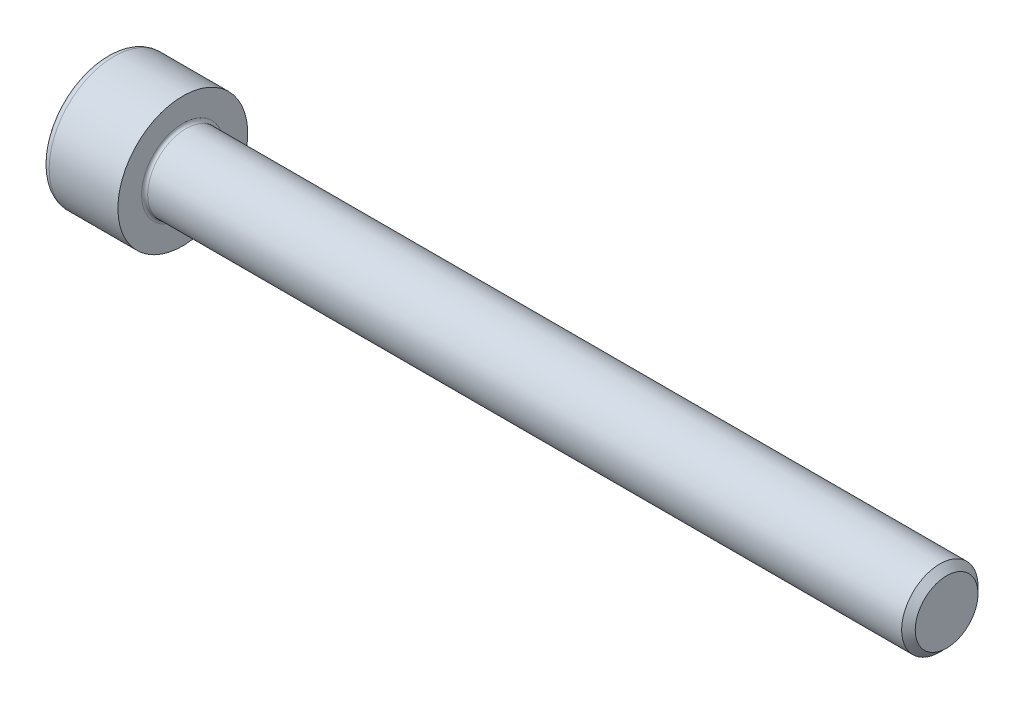
ISO-10303-21;
HEADER;
FILE_DESCRIPTION(('STEP AP214'),'2;1');
FILE_NAME('part.step','',(''),(''),'','','');
FILE_SCHEMA(('AUTOMOTIVE_DESIGN { 1 0 10303 214 1 1 1 1 }'));
ENDSEC;
DATA;
#1=APPLICATION_CONTEXT('core data for automotive mechanical design processes');
#2=APPLICATION_PROTOCOL_DEFINITION('international standard','automotive_design',2000,#1);
#3=PRODUCT_CONTEXT('',#1,'mechanical');
#4=PRODUCT('Part','Part','',(#3));
#5=PRODUCT_RELATED_PRODUCT_CATEGORY('part','',(#4));
#6=PRODUCT_DEFINITION_FORMATION('','',#4);
#7=PRODUCT_DEFINITION_CONTEXT('part definition',#1,'design');
#8=PRODUCT_DEFINITION('design','',#6,#7);
#9=PRODUCT_DEFINITION_SHAPE('','',#8);
#10=(LENGTH_UNIT() NAMED_UNIT(*) SI_UNIT(.MILLI.,.METRE.));
#11=(NAMED_UNIT(*) PLANE_ANGLE_UNIT() SI_UNIT($,.RADIAN.));
#12=(NAMED_UNIT(*) SI_UNIT($,.STERADIAN.) SOLID_ANGLE_UNIT());
#13=UNCERTAINTY_MEASURE_WITH_UNIT(LENGTH_MEASURE(1.E-05),#10,'distance_accuracy_value','');
#14=(GEOMETRIC_REPRESENTATION_CONTEXT(3) GLOBAL_UNCERTAINTY_ASSIGNED_CONTEXT((#13)) GLOBAL_UNIT_ASSIGNED_CONTEXT((#10,
#11,#12)) REPRESENTATION_CONTEXT('',''));
#15=CARTESIAN_POINT('',(0.,0.,0.));
#16=DIRECTION('',(0.,0.,1.));
#17=DIRECTION('',(1.,0.,0.));
#18=AXIS2_PLACEMENT_3D('',#15,#16,#17);
#19=CARTESIAN_POINT('',(0.,0.,0.));
#20=DIRECTION('',(-1.,0.,0.));
#21=DIRECTION('',(0.,0.,1.));
#22=AXIS2_PLACEMENT_3D('',#19,#20,#21);
#23=PLANE('',#22);
#24=DIRECTION('',(0.,-0.499999999999999,0.866025403784439));
#25=VECTOR('',#24,1.);
#26=CARTESIAN_POINT('',(0.,2.32094808214229,0.));
#27=LINE('',#26,#25);
#28=CARTESIAN_POINT('',(0.,2.32094808214229,0.));
#29=VERTEX_POINT('',#28);
#30=CARTESIAN_POINT('',(0.,1.16047404107115,2.01));
#31=VERTEX_POINT('',#30);
#32=EDGE_CURVE('E373',#29,#31,#27,.T.);
#33=ORIENTED_EDGE('',*,*,#32,.T.);
#34=DIRECTION('',(0.,1.,0.));
#35=VECTOR('',#34,1.);
#36=CARTESIAN_POINT('',(0.,-1.16047404107115,2.01));
#37=LINE('',#36,#35);
#38=CARTESIAN_POINT('',(0.,-1.16047404107115,2.01));
#39=VERTEX_POINT('',#38);
#40=EDGE_CURVE('E130',#39,#31,#37,.T.);
#41=ORIENTED_EDGE('',*,*,#40,.F.);
#42=DIRECTION('',(0.,-0.500000000000001,-0.866025403784438));
#43=VECTOR('',#42,1.);
#44=CARTESIAN_POINT('',(0.,-1.16047404107115,2.01));
#45=LINE('',#44,#43);
#46=CARTESIAN_POINT('',(0.,-2.3209480821423,0.));
#47=VERTEX_POINT('',#46);
#48=EDGE_CURVE('E376',#39,#47,#45,.T.);
#49=ORIENTED_EDGE('',*,*,#48,.T.);
#50=DIRECTION('',(0.,0.499999999999999,-0.866025403784439));
#51=VECTOR('',#50,1.);
#52=CARTESIAN_POINT('',(0.,-2.3209480821423,0.));
#53=LINE('',#52,#51);
#54=CARTESIAN_POINT('',(0.,-1.16047404107116,-2.01));
#55=VERTEX_POINT('',#54);
#56=EDGE_CURVE('E379',#47,#55,#53,.T.);
#57=ORIENTED_EDGE('',*,*,#56,.T.);
#58=DIRECTION('',(0.,-1.,0.));
#59=VECTOR('',#58,1.);
#60=CARTESIAN_POINT('',(0.,1.16047404107114,-2.01));
#61=LINE('',#60,#59);
#62=CARTESIAN_POINT('',(0.,1.16047404107114,-2.01));
#63=VERTEX_POINT('',#62);
#64=EDGE_CURVE('E382',#63,#55,#61,.T.);
#65=ORIENTED_EDGE('',*,*,#64,.F.);
#66=DIRECTION('',(0.,-0.500000000000001,-0.866025403784438));
#67=VECTOR('',#66,1.);
#68=CARTESIAN_POINT('',(0.,2.32094808214229,0.));
#69=LINE('',#68,#67);
#70=EDGE_CURVE('E125',#29,#63,#69,.T.);
#71=ORIENTED_EDGE('',*,*,#70,.F.);
#72=EDGE_LOOP('',(#33,#41,#49,#57,#65,#71));
#73=FACE_BOUND('',#72,.T.);
#74=CARTESIAN_POINT('',(0.,0.,0.));
#75=DIRECTION('',(-1.,0.,0.));
#76=DIRECTION('',(0.,0.,1.));
#77=AXIS2_PLACEMENT_3D('',#74,#75,#76);
#78=CIRCLE('',#77,3.75);
#79=CARTESIAN_POINT('',(0.,0.,3.75));
#80=VERTEX_POINT('',#79);
#81=EDGE_CURVE('E42',#80,#80,#78,.T.);
#82=ORIENTED_EDGE('',*,*,#81,.T.);
#83=EDGE_LOOP('',(#82));
#84=FACE_BOUND('',#83,.T.);
#85=ADVANCED_FACE('F34',(#73,#84),#23,.T.);
#86=CARTESIAN_POINT('',(55.,2.055,0.));
#87=DIRECTION('',(1.,0.,0.));
#88=DIRECTION('',(0.,0.,-1.));
#89=AXIS2_PLACEMENT_3D('',#86,#87,#88);
#90=PLANE('',#89);
#91=CARTESIAN_POINT('',(55.,0.,0.));
#92=DIRECTION('',(-1.,0.,0.));
#93=DIRECTION('',(0.,0.,1.));
#94=AXIS2_PLACEMENT_3D('',#91,#92,#93);
#95=CIRCLE('',#94,2.055);
#96=CARTESIAN_POINT('',(55.,0.,2.055));
#97=VERTEX_POINT('',#96);
#98=EDGE_CURVE('E148',#97,#97,#95,.T.);
#99=ORIENTED_EDGE('',*,*,#98,.F.);
#100=EDGE_LOOP('',(#99));
#101=FACE_BOUND('',#100,.T.);
#102=ADVANCED_FACE('F172',(#101),#90,.T.);
#103=CARTESIAN_POINT('',(55.,0.,0.));
#104=DIRECTION('',(-1.,0.,0.));
#105=DIRECTION('',(0.,0.,1.));
#106=AXIS2_PLACEMENT_3D('',#103,#104,#105);
#107=CONICAL_SURFACE('',#106,2.055,0.785398163397316);
#108=CARTESIAN_POINT('',(54.5549999999999,0.,0.));
#109=DIRECTION('',(-1.,0.,0.));
#110=DIRECTION('',(0.,0.,1.));
#111=AXIS2_PLACEMENT_3D('',#108,#109,#110);
#112=CIRCLE('',#111,2.49999999999994);
#113=CARTESIAN_POINT('',(54.5549999999999,0.,2.49999999999994));
#114=VERTEX_POINT('',#113);
#115=EDGE_CURVE('E145',#114,#114,#112,.T.);
#116=ORIENTED_EDGE('',*,*,#115,.F.);
#117=EDGE_LOOP('',(#116));
#118=FACE_BOUND('',#117,.T.);
#119=ORIENTED_EDGE('',*,*,#98,.T.);
#120=EDGE_LOOP('',(#119));
#121=FACE_BOUND('',#120,.T.);
#122=ADVANCED_FACE('F178',(#118,#121),#107,.T.);
#123=CARTESIAN_POINT('',(-31.75,0.,0.));
#124=DIRECTION('',(-1.,0.,0.));
#125=DIRECTION('',(0.,0.,1.));
#126=AXIS2_PLACEMENT_3D('',#123,#124,#125);
#127=CYLINDRICAL_SURFACE('',#126,2.49999999999997);
#128=CARTESIAN_POINT('',(5.2,0.,0.));
#129=DIRECTION('',(1.,0.,0.));
#130=DIRECTION('',(0.,0.,-1.));
#131=AXIS2_PLACEMENT_3D('',#128,#129,#130);
#132=CIRCLE('',#131,2.49999999999997);
#133=CARTESIAN_POINT('',(5.2,0.,-2.49999999999997));
#134=VERTEX_POINT('',#133);
#135=EDGE_CURVE('E154',#134,#134,#132,.T.);
#136=ORIENTED_EDGE('',*,*,#135,.T.);
#137=EDGE_LOOP('',(#136));
#138=FACE_BOUND('',#137,.T.);
#139=ORIENTED_EDGE('',*,*,#115,.T.);
#140=EDGE_LOOP('',(#139));
#141=FACE_BOUND('',#140,.T.);
#142=ADVANCED_FACE('F190',(#138,#141),#127,.T.);
#143=CARTESIAN_POINT('',(5.,4.25,0.));
#144=DIRECTION('',(1.,0.,0.));
#145=DIRECTION('',(0.,0.,-1.));
#146=AXIS2_PLACEMENT_3D('',#143,#144,#145);
#147=PLANE('',#146);
#148=CARTESIAN_POINT('',(5.,0.,0.));
#149=DIRECTION('',(1.,0.,0.));
#150=DIRECTION('',(0.,0.,-1.));
#151=AXIS2_PLACEMENT_3D('',#148,#149,#150);
#152=CIRCLE('',#151,2.69999999999997);
#153=CARTESIAN_POINT('',(5.,0.,-2.69999999999997));
#154=VERTEX_POINT('',#153);
#155=EDGE_CURVE('E151',#154,#154,#152,.F.);
#156=ORIENTED_EDGE('',*,*,#155,.T.);
#157=EDGE_LOOP('',(#156));
#158=FACE_BOUND('',#157,.T.);
#159=CARTESIAN_POINT('',(5.,0.,0.));
#160=DIRECTION('',(-1.,0.,0.));
#161=DIRECTION('',(0.,0.,1.));
#162=AXIS2_PLACEMENT_3D('',#159,#160,#161);
#163=CIRCLE('',#162,4.25);
#164=CARTESIAN_POINT('',(5.,0.,4.25));
#165=VERTEX_POINT('',#164);
#166=EDGE_CURVE('E141',#165,#165,#163,.T.);
#167=ORIENTED_EDGE('',*,*,#166,.F.);
#168=EDGE_LOOP('',(#167));
#169=FACE_BOUND('',#168,.T.);
#170=ADVANCED_FACE('F186',(#158,#169),#147,.T.);
#171=CARTESIAN_POINT('',(-31.75,0.,0.));
#172=DIRECTION('',(-1.,0.,0.));
#173=DIRECTION('',(0.,0.,1.));
#174=AXIS2_PLACEMENT_3D('',#171,#172,#173);
#175=CYLINDRICAL_SURFACE('',#174,4.25);
#176=CARTESIAN_POINT('',(0.5,0.,0.));
#177=DIRECTION('',(-1.,0.,0.));
#178=DIRECTION('',(0.,0.,1.));
#179=AXIS2_PLACEMENT_3D('',#176,#177,#178);
#180=CIRCLE('',#179,4.25);
#181=CARTESIAN_POINT('',(0.5,0.,4.25));
#182=VERTEX_POINT('',#181);
#183=EDGE_CURVE('E11',#182,#182,#180,.F.);
#184=ORIENTED_EDGE('',*,*,#183,.T.);
#185=EDGE_LOOP('',(#184));
#186=FACE_BOUND('',#185,.T.);
#187=ORIENTED_EDGE('',*,*,#166,.T.);
#188=EDGE_LOOP('',(#187));
#189=FACE_BOUND('',#188,.T.);
#190=ADVANCED_FACE('F168',(#186,#189),#175,.T.);
#191=CARTESIAN_POINT('',(5.2,0.,0.));
#192=DIRECTION('',(1.,0.,0.));
#193=DIRECTION('',(0.,0.,-1.));
#194=AXIS2_PLACEMENT_3D('',#191,#192,#193);
#195=TOROIDAL_SURFACE('',#194,2.69999999999997,0.2);
#196=ORIENTED_EDGE('',*,*,#135,.F.);
#197=EDGE_LOOP('',(#196));
#198=FACE_BOUND('',#197,.T.);
#199=ORIENTED_EDGE('',*,*,#155,.F.);
#200=EDGE_LOOP('',(#199));
#201=FACE_BOUND('',#200,.T.);
#202=ADVANCED_FACE('F161',(#198,#201),#195,.F.);
#203=CARTESIAN_POINT('',(0.5,0.,0.));
#204=DIRECTION('',(-1.,0.,0.));
#205=DIRECTION('',(0.,0.,1.));
#206=AXIS2_PLACEMENT_3D('',#203,#204,#205);
#207=TOROIDAL_SURFACE('',#206,3.75,0.5);
#208=ORIENTED_EDGE('',*,*,#183,.F.);
#209=EDGE_LOOP('',(#208));
#210=FACE_BOUND('',#209,.T.);
#211=ORIENTED_EDGE('',*,*,#81,.F.);
#212=EDGE_LOOP('',(#211));
#213=FACE_BOUND('',#212,.T.);
#214=ADVANCED_FACE('F36',(#210,#213),#207,.T.);
#215=CARTESIAN_POINT('',(2.5,2.32094808214229,0.));
#216=DIRECTION('',(0.,-0.866025403784439,-0.499999999999999));
#217=DIRECTION('',(0.,0.499999999999999,-0.866025403784439));
#218=AXIS2_PLACEMENT_3D('',#215,#216,#217);
#219=PLANE('',#218);
#220=ORIENTED_EDGE('',*,*,#32,.F.);
#221=DIRECTION('',(-1.,0.,0.));
#222=VECTOR('',#221,1.);
#223=CARTESIAN_POINT('',(2.5,2.32094808214229,0.));
#224=LINE('',#223,#222);
#225=CARTESIAN_POINT('',(2.5,2.32094808214229,0.));
#226=VERTEX_POINT('',#225);
#227=EDGE_CURVE('E363',#226,#29,#224,.T.);
#228=ORIENTED_EDGE('',*,*,#227,.F.);
#229=DIRECTION('',(0.,-0.499999999999999,0.866025403784439));
#230=VECTOR('',#229,1.);
#231=CARTESIAN_POINT('',(2.5,2.32094808214229,0.));
#232=LINE('',#231,#230);
#233=CARTESIAN_POINT('',(2.5,1.74071106160672,1.00499999999999));
#234=VERTEX_POINT('',#233);
#235=EDGE_CURVE('E117',#226,#234,#232,.T.);
#236=ORIENTED_EDGE('',*,*,#235,.T.);
#237=CARTESIAN_POINT('',(2.5,1.16047404107115,2.01));
#238=VERTEX_POINT('',#237);
#239=EDGE_CURVE('E108',#234,#238,#232,.T.);
#240=ORIENTED_EDGE('',*,*,#239,.T.);
#241=DIRECTION('',(-1.,0.,0.));
#242=VECTOR('',#241,1.);
#243=CARTESIAN_POINT('',(2.5,1.16047404107115,2.01));
#244=LINE('',#243,#242);
#245=EDGE_CURVE('E122',#238,#31,#244,.T.);
#246=ORIENTED_EDGE('',*,*,#245,.T.);
#247=EDGE_LOOP('',(#220,#228,#236,#240,#246));
#248=FACE_BOUND('',#247,.T.);
#249=ADVANCED_FACE('F121',(#248),#219,.T.);
#250=CARTESIAN_POINT('',(2.5,-1.16047404107115,2.01));
#251=DIRECTION('',(0.,0.,1.));
#252=DIRECTION('',(0.,-1.,0.));
#253=AXIS2_PLACEMENT_3D('',#250,#251,#252);
#254=PLANE('',#253);
#255=ORIENTED_EDGE('',*,*,#40,.T.);
#256=ORIENTED_EDGE('',*,*,#245,.F.);
#257=DIRECTION('',(0.,1.,0.));
#258=VECTOR('',#257,1.);
#259=CARTESIAN_POINT('',(2.5,-1.16047404107115,2.01));
#260=LINE('',#259,#258);
#261=CARTESIAN_POINT('',(2.5,0.,2.01));
#262=VERTEX_POINT('',#261);
#263=EDGE_CURVE('E105',#262,#238,#260,.T.);
#264=ORIENTED_EDGE('',*,*,#263,.F.);
#265=CARTESIAN_POINT('',(2.5,-1.16047404107115,2.01));
#266=VERTEX_POINT('',#265);
#267=EDGE_CURVE('E116',#266,#262,#260,.T.);
#268=ORIENTED_EDGE('',*,*,#267,.F.);
#269=DIRECTION('',(-1.,0.,0.));
#270=VECTOR('',#269,1.);
#271=CARTESIAN_POINT('',(2.5,-1.16047404107115,2.01));
#272=LINE('',#271,#270);
#273=EDGE_CURVE('E132',#266,#39,#272,.T.);
#274=ORIENTED_EDGE('',*,*,#273,.T.);
#275=EDGE_LOOP('',(#255,#256,#264,#268,#274));
#276=FACE_BOUND('',#275,.T.);
#277=ADVANCED_FACE('F127',(#276),#254,.F.);
#278=CARTESIAN_POINT('',(2.5,-1.16047404107115,2.01));
#279=DIRECTION('',(0.,0.866025403784438,-0.500000000000001));
#280=DIRECTION('',(0.,0.500000000000001,0.866025403784438));
#281=AXIS2_PLACEMENT_3D('',#278,#279,#280);
#282=PLANE('',#281);
#283=ORIENTED_EDGE('',*,*,#48,.F.);
#284=ORIENTED_EDGE('',*,*,#273,.F.);
#285=DIRECTION('',(0.,-0.500000000000001,-0.866025403784438));
#286=VECTOR('',#285,1.);
#287=CARTESIAN_POINT('',(2.5,-1.16047404107115,2.01));
#288=LINE('',#287,#286);
#289=CARTESIAN_POINT('',(2.5,-1.74071106160672,1.005));
#290=VERTEX_POINT('',#289);
#291=EDGE_CURVE('E402',#266,#290,#288,.T.);
#292=ORIENTED_EDGE('',*,*,#291,.T.);
#293=CARTESIAN_POINT('',(2.5,-2.3209480821423,0.));
#294=VERTEX_POINT('',#293);
#295=EDGE_CURVE('E391',#290,#294,#288,.T.);
#296=ORIENTED_EDGE('',*,*,#295,.T.);
#297=DIRECTION('',(-1.,0.,0.));
#298=VECTOR('',#297,1.);
#299=CARTESIAN_POINT('',(2.5,-2.3209480821423,0.));
#300=LINE('',#299,#298);
#301=EDGE_CURVE('E137',#294,#47,#300,.T.);
#302=ORIENTED_EDGE('',*,*,#301,.T.);
#303=EDGE_LOOP('',(#283,#284,#292,#296,#302));
#304=FACE_BOUND('',#303,.T.);
#305=ADVANCED_FACE('F254',(#304),#282,.T.);
#306=CARTESIAN_POINT('',(2.5,-2.3209480821423,0.));
#307=DIRECTION('',(0.,0.866025403784439,0.499999999999999));
#308=DIRECTION('',(0.,-0.499999999999999,0.86602540378444));
#309=AXIS2_PLACEMENT_3D('',#306,#307,#308);
#310=PLANE('',#309);
#311=ORIENTED_EDGE('',*,*,#56,.F.);
#312=ORIENTED_EDGE('',*,*,#301,.F.);
#313=DIRECTION('',(0.,0.499999999999999,-0.866025403784439));
#314=VECTOR('',#313,1.);
#315=CARTESIAN_POINT('',(2.5,-2.3209480821423,0.));
#316=LINE('',#315,#314);
#317=CARTESIAN_POINT('',(2.5,-1.74071106160673,-1.005));
#318=VERTEX_POINT('',#317);
#319=EDGE_CURVE('E369',#294,#318,#316,.T.);
#320=ORIENTED_EDGE('',*,*,#319,.T.);
#321=CARTESIAN_POINT('',(2.5,-1.16047404107116,-2.01));
#322=VERTEX_POINT('',#321);
#323=EDGE_CURVE('E401',#318,#322,#316,.T.);
#324=ORIENTED_EDGE('',*,*,#323,.T.);
#325=DIRECTION('',(-1.,0.,0.));
#326=VECTOR('',#325,1.);
#327=CARTESIAN_POINT('',(2.5,-1.16047404107116,-2.01));
#328=LINE('',#327,#326);
#329=EDGE_CURVE('E362',#322,#55,#328,.T.);
#330=ORIENTED_EDGE('',*,*,#329,.T.);
#331=EDGE_LOOP('',(#311,#312,#320,#324,#330));
#332=FACE_BOUND('',#331,.T.);
#333=ADVANCED_FACE('F262',(#332),#310,.T.);
#334=CARTESIAN_POINT('',(2.5,1.16047404107114,-2.01));
#335=DIRECTION('',(0.,0.,-1.));
#336=DIRECTION('',(0.,1.,0.));
#337=AXIS2_PLACEMENT_3D('',#334,#335,#336);
#338=PLANE('',#337);
#339=ORIENTED_EDGE('',*,*,#64,.T.);
#340=ORIENTED_EDGE('',*,*,#329,.F.);
#341=DIRECTION('',(0.,-1.,0.));
#342=VECTOR('',#341,1.);
#343=CARTESIAN_POINT('',(2.5,1.16047404107114,-2.01));
#344=LINE('',#343,#342);
#345=CARTESIAN_POINT('',(2.5,0.,-2.01));
#346=VERTEX_POINT('',#345);
#347=EDGE_CURVE('E366',#346,#322,#344,.T.);
#348=ORIENTED_EDGE('',*,*,#347,.F.);
#349=CARTESIAN_POINT('',(2.5,1.16047404107114,-2.01));
#350=VERTEX_POINT('',#349);
#351=EDGE_CURVE('E49',#350,#346,#344,.T.);
#352=ORIENTED_EDGE('',*,*,#351,.F.);
#353=DIRECTION('',(-1.,0.,0.));
#354=VECTOR('',#353,1.);
#355=CARTESIAN_POINT('',(2.5,1.16047404107114,-2.01));
#356=LINE('',#355,#354);
#357=EDGE_CURVE('E359',#350,#63,#356,.T.);
#358=ORIENTED_EDGE('',*,*,#357,.T.);
#359=EDGE_LOOP('',(#339,#340,#348,#352,#358));
#360=FACE_BOUND('',#359,.T.);
#361=ADVANCED_FACE('F271',(#360),#338,.F.);
#362=CARTESIAN_POINT('',(2.5,2.32094808214229,0.));
#363=DIRECTION('',(0.,0.866025403784438,-0.500000000000001));
#364=DIRECTION('',(0.,0.500000000000001,0.866025403784438));
#365=AXIS2_PLACEMENT_3D('',#362,#363,#364);
#366=PLANE('',#365);
#367=ORIENTED_EDGE('',*,*,#70,.T.);
#368=ORIENTED_EDGE('',*,*,#357,.F.);
#369=DIRECTION('',(0.,-0.500000000000001,-0.866025403784438));
#370=VECTOR('',#369,1.);
#371=CARTESIAN_POINT('',(2.5,2.32094808214229,0.));
#372=LINE('',#371,#370);
#373=CARTESIAN_POINT('',(2.5,1.74071106160672,-1.005));
#374=VERTEX_POINT('',#373);
#375=EDGE_CURVE('E349',#374,#350,#372,.T.);
#376=ORIENTED_EDGE('',*,*,#375,.F.);
#377=EDGE_CURVE('E355',#226,#374,#372,.T.);
#378=ORIENTED_EDGE('',*,*,#377,.F.);
#379=ORIENTED_EDGE('',*,*,#227,.T.);
#380=EDGE_LOOP('',(#367,#368,#376,#378,#379));
#381=FACE_BOUND('',#380,.T.);
#382=ADVANCED_FACE('F280',(#381),#366,.F.);
#383=CARTESIAN_POINT('',(2.5,2.32094808214229,0.));
#384=DIRECTION('',(1.,0.,0.));
#385=DIRECTION('',(0.,0.,-1.));
#386=AXIS2_PLACEMENT_3D('',#383,#384,#385);
#387=PLANE('',#386);
#388=ORIENTED_EDGE('',*,*,#347,.T.);
#389=ORIENTED_EDGE('',*,*,#323,.F.);
#390=CARTESIAN_POINT('',(2.5,0.,0.));
#391=DIRECTION('',(-1.,0.,0.));
#392=DIRECTION('',(0.,0.,1.));
#393=AXIS2_PLACEMENT_3D('',#390,#391,#392);
#394=CIRCLE('',#393,2.01);
#395=EDGE_CURVE('E397',#346,#318,#394,.T.);
#396=ORIENTED_EDGE('',*,*,#395,.F.);
#397=EDGE_LOOP('',(#388,#389,#396));
#398=FACE_BOUND('',#397,.T.);
#399=ADVANCED_FACE('F289',(#398),#387,.F.);
#400=ORIENTED_EDGE('',*,*,#319,.F.);
#401=ORIENTED_EDGE('',*,*,#295,.F.);
#402=EDGE_CURVE('E135',#318,#290,#394,.T.);
#403=ORIENTED_EDGE('',*,*,#402,.F.);
#404=EDGE_LOOP('',(#400,#401,#403));
#405=FACE_BOUND('',#404,.T.);
#406=ADVANCED_FACE('F298',(#405),#387,.F.);
#407=ORIENTED_EDGE('',*,*,#291,.F.);
#408=ORIENTED_EDGE('',*,*,#267,.T.);
#409=EDGE_CURVE('E131',#290,#262,#394,.T.);
#410=ORIENTED_EDGE('',*,*,#409,.F.);
#411=EDGE_LOOP('',(#407,#408,#410));
#412=FACE_BOUND('',#411,.T.);
#413=ADVANCED_FACE('F307',(#412),#387,.F.);
#414=ORIENTED_EDGE('',*,*,#263,.T.);
#415=ORIENTED_EDGE('',*,*,#239,.F.);
#416=EDGE_CURVE('E111',#262,#234,#394,.T.);
#417=ORIENTED_EDGE('',*,*,#416,.F.);
#418=EDGE_LOOP('',(#414,#415,#417));
#419=FACE_BOUND('',#418,.T.);
#420=ADVANCED_FACE('F107',(#419),#387,.F.);
#421=ORIENTED_EDGE('',*,*,#235,.F.);
#422=ORIENTED_EDGE('',*,*,#377,.T.);
#423=EDGE_CURVE('E142',#234,#374,#394,.T.);
#424=ORIENTED_EDGE('',*,*,#423,.F.);
#425=EDGE_LOOP('',(#421,#422,#424));
#426=FACE_BOUND('',#425,.T.);
#427=ADVANCED_FACE('F322',(#426),#387,.F.);
#428=ORIENTED_EDGE('',*,*,#375,.T.);
#429=ORIENTED_EDGE('',*,*,#351,.T.);
#430=EDGE_CURVE('E352',#374,#346,#394,.T.);
#431=ORIENTED_EDGE('',*,*,#430,.F.);
#432=EDGE_LOOP('',(#428,#429,#431));
#433=FACE_BOUND('',#432,.T.);
#434=ADVANCED_FACE('F237',(#433),#387,.F.);
#435=CARTESIAN_POINT('',(2.5,0.,0.));
#436=DIRECTION('',(-1.,0.,0.));
#437=DIRECTION('',(0.,0.,1.));
#438=AXIS2_PLACEMENT_3D('',#435,#436,#437);
#439=CONICAL_SURFACE('',#438,2.01,1.04719755119659);
#440=CARTESIAN_POINT('',(3.66047404107116,0.,0.));
#441=VERTEX_POINT('',#440);
#442=VERTEX_LOOP('',#441);
#443=FACE_BOUND('',#442,.T.);
#444=ORIENTED_EDGE('',*,*,#416,.T.);
#445=ORIENTED_EDGE('',*,*,#423,.T.);
#446=ORIENTED_EDGE('',*,*,#430,.T.);
#447=ORIENTED_EDGE('',*,*,#395,.T.);
#448=ORIENTED_EDGE('',*,*,#402,.T.);
#449=ORIENTED_EDGE('',*,*,#409,.T.);
#450=EDGE_LOOP('',(#444,#445,#446,#447,#448,#449));
#451=FACE_BOUND('',#450,.T.);
#452=ADVANCED_FACE('F183',(#443,#451),#439,.F.);
#453=CLOSED_SHELL('',(#85,#102,#122,#142,#170,#190,#202,#214,#249,#277,#305,#333,#361,#382,#399,
#406,#413,#420,#427,#434,#452));
#454=MANIFOLD_SOLID_BREP('B2',#453);
#455=ADVANCED_BREP_SHAPE_REPRESENTATION('',(#18,#454),#14);
#456=SHAPE_DEFINITION_REPRESENTATION(#9,#455);
ENDSEC;
END-ISO-10303-21;
